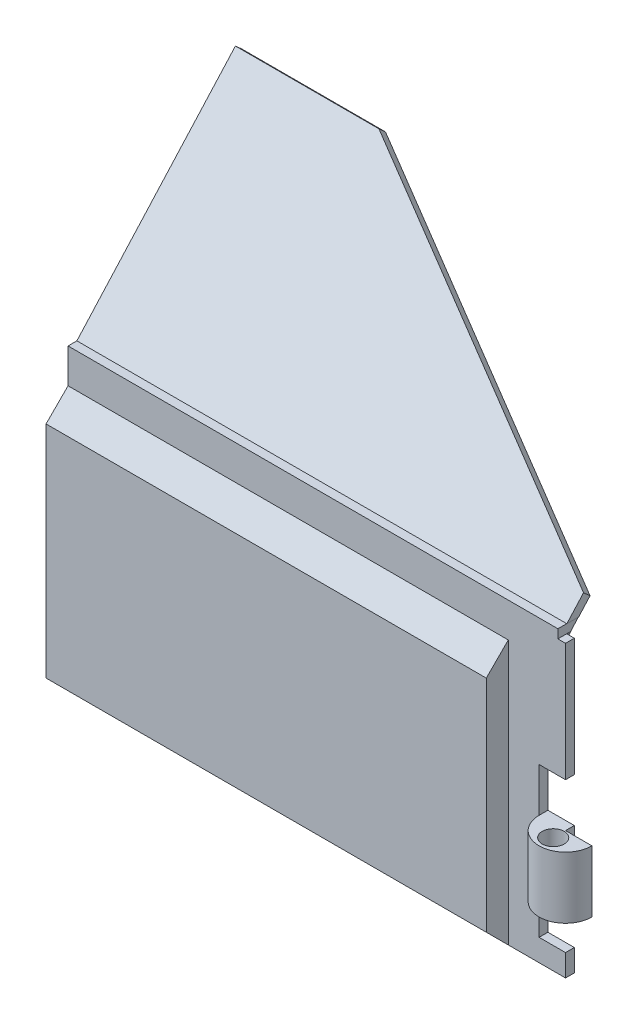
ISO-10303-21;
HEADER;
FILE_DESCRIPTION(('STEP AP214'),'2;1');
FILE_NAME('part.step','',(''),(''),'','','');
FILE_SCHEMA(('AUTOMOTIVE_DESIGN { 1 0 10303 214 1 1 1 1 }'));
ENDSEC;
DATA;
#1=APPLICATION_CONTEXT('core data for automotive mechanical design processes');
#2=APPLICATION_PROTOCOL_DEFINITION('international standard','automotive_design',2000,#1);
#3=PRODUCT_CONTEXT('',#1,'mechanical');
#4=PRODUCT('Part','Part','',(#3));
#5=PRODUCT_RELATED_PRODUCT_CATEGORY('part','',(#4));
#6=PRODUCT_DEFINITION_FORMATION('','',#4);
#7=PRODUCT_DEFINITION_CONTEXT('part definition',#1,'design');
#8=PRODUCT_DEFINITION('design','',#6,#7);
#9=PRODUCT_DEFINITION_SHAPE('','',#8);
#10=(LENGTH_UNIT() NAMED_UNIT(*) SI_UNIT(.MILLI.,.METRE.));
#11=(NAMED_UNIT(*) PLANE_ANGLE_UNIT() SI_UNIT($,.RADIAN.));
#12=(NAMED_UNIT(*) SI_UNIT($,.STERADIAN.) SOLID_ANGLE_UNIT());
#13=UNCERTAINTY_MEASURE_WITH_UNIT(LENGTH_MEASURE(1.E-05),#10,'distance_accuracy_value','');
#14=(GEOMETRIC_REPRESENTATION_CONTEXT(3) GLOBAL_UNCERTAINTY_ASSIGNED_CONTEXT((#13)) GLOBAL_UNIT_ASSIGNED_CONTEXT((#10,
#11,#12)) REPRESENTATION_CONTEXT('',''));
#15=CARTESIAN_POINT('',(0.,0.,0.));
#16=DIRECTION('',(0.,0.,1.));
#17=DIRECTION('',(1.,0.,0.));
#18=AXIS2_PLACEMENT_3D('',#15,#16,#17);
#19=CARTESIAN_POINT('',(27.4,-35.8801046027084,46.231811155793));
#20=DIRECTION('',(-1.,0.,0.));
#21=DIRECTION('',(0.,-1.,0.));
#22=AXIS2_PLACEMENT_3D('',#19,#20,#21);
#23=PLANE('',#22);
#24=DIRECTION('',(0.,0.743144825477395,-0.669130606358857));
#25=VECTOR('',#24,1.);
#26=CARTESIAN_POINT('',(27.4,-35.8801046027084,46.231811155793));
#27=LINE('',#26,#25);
#28=CARTESIAN_POINT('',(27.4,15.4655234501354,0.));
#29=VERTEX_POINT('',#28);
#30=CARTESIAN_POINT('',(27.4,15.96,-0.445228685308535));
#31=VERTEX_POINT('',#30);
#32=EDGE_CURVE('E227',#29,#31,#27,.T.);
#33=ORIENTED_EDGE('',*,*,#32,.T.);
#34=DIRECTION('',(0.,0.,1.));
#35=VECTOR('',#34,1.);
#36=CARTESIAN_POINT('',(27.4,15.96,46.231811155793));
#37=LINE('',#36,#35);
#38=CARTESIAN_POINT('',(27.4,15.96,0.));
#39=VERTEX_POINT('',#38);
#40=EDGE_CURVE('E11',#31,#39,#37,.T.);
#41=ORIENTED_EDGE('',*,*,#40,.T.);
#42=DIRECTION('',(0.,1.,0.));
#43=VECTOR('',#42,1.);
#44=CARTESIAN_POINT('',(27.4,-35.8801046027084,0.));
#45=LINE('',#44,#43);
#46=EDGE_CURVE('E212',#29,#39,#45,.T.);
#47=ORIENTED_EDGE('',*,*,#46,.F.);
#48=EDGE_LOOP('',(#33,#41,#47));
#49=FACE_BOUND('',#48,.T.);
#50=ADVANCED_FACE('F35',(#49),#23,.F.);
#51=CARTESIAN_POINT('',(25.25,2.54,1.));
#52=DIRECTION('',(0.,1.,0.));
#53=DIRECTION('',(0.,0.,1.));
#54=AXIS2_PLACEMENT_3D('',#51,#52,#53);
#55=PLANE('',#54);
#56=DIRECTION('',(1.,0.,0.));
#57=VECTOR('',#56,1.);
#58=CARTESIAN_POINT('',(25.25,2.54,0.));
#59=LINE('',#58,#57);
#60=CARTESIAN_POINT('',(25.25,2.54,0.));
#61=VERTEX_POINT('',#60);
#62=CARTESIAN_POINT('',(28.25,2.54,0.));
#63=VERTEX_POINT('',#62);
#64=EDGE_CURVE('E172',#61,#63,#59,.T.);
#65=ORIENTED_EDGE('',*,*,#64,.T.);
#66=DIRECTION('',(0.,0.,-1.));
#67=VECTOR('',#66,1.);
#68=CARTESIAN_POINT('',(28.25,2.54,1.));
#69=LINE('',#68,#67);
#70=CARTESIAN_POINT('',(28.25,2.54,1.));
#71=VERTEX_POINT('',#70);
#72=EDGE_CURVE('E43',#71,#63,#69,.T.);
#73=ORIENTED_EDGE('',*,*,#72,.F.);
#74=DIRECTION('',(1.,0.,0.));
#75=VECTOR('',#74,1.);
#76=CARTESIAN_POINT('',(25.25,2.54,1.));
#77=LINE('',#76,#75);
#78=CARTESIAN_POINT('',(25.25,2.54,1.));
#79=VERTEX_POINT('',#78);
#80=EDGE_CURVE('E173',#79,#71,#77,.T.);
#81=ORIENTED_EDGE('',*,*,#80,.F.);
#82=DIRECTION('',(0.,0.,-1.));
#83=VECTOR('',#82,1.);
#84=CARTESIAN_POINT('',(25.25,2.54,1.));
#85=LINE('',#84,#83);
#86=EDGE_CURVE('E189',#79,#61,#85,.T.);
#87=ORIENTED_EDGE('',*,*,#86,.T.);
#88=EDGE_LOOP('',(#65,#73,#81,#87));
#89=FACE_BOUND('',#88,.T.);
#90=ADVANCED_FACE('F37',(#89),#55,.F.);
#91=CARTESIAN_POINT('',(28.25,2.54,1.));
#92=DIRECTION('',(-1.,0.,0.));
#93=DIRECTION('',(0.,0.,1.));
#94=AXIS2_PLACEMENT_3D('',#91,#92,#93);
#95=PLANE('',#94);
#96=DIRECTION('',(0.,1.,0.));
#97=VECTOR('',#96,1.);
#98=CARTESIAN_POINT('',(28.25,2.54,0.));
#99=LINE('',#98,#97);
#100=CARTESIAN_POINT('',(28.25,15.96,0.));
#101=VERTEX_POINT('',#100);
#102=EDGE_CURVE('E192',#63,#101,#99,.T.);
#103=ORIENTED_EDGE('',*,*,#102,.T.);
#104=DIRECTION('',(0.,0.,1.));
#105=VECTOR('',#104,1.);
#106=CARTESIAN_POINT('',(28.25,15.96,-2.44997656798041));
#107=LINE('',#106,#105);
#108=CARTESIAN_POINT('',(28.25,15.96,1.));
#109=VERTEX_POINT('',#108);
#110=EDGE_CURVE('E488',#101,#109,#107,.T.);
#111=ORIENTED_EDGE('',*,*,#110,.T.);
#112=DIRECTION('',(0.,1.,0.));
#113=VECTOR('',#112,1.);
#114=CARTESIAN_POINT('',(28.25,2.54,1.));
#115=LINE('',#114,#113);
#116=EDGE_CURVE('E108',#71,#109,#115,.T.);
#117=ORIENTED_EDGE('',*,*,#116,.F.);
#118=ORIENTED_EDGE('',*,*,#72,.T.);
#119=EDGE_LOOP('',(#103,#111,#117,#118));
#120=FACE_BOUND('',#119,.T.);
#121=ADVANCED_FACE('F320',(#120),#95,.F.);
#122=CARTESIAN_POINT('',(28.25,16.96,1.));
#123=DIRECTION('',(0.,-1.,0.));
#124=DIRECTION('',(0.,0.,-1.));
#125=AXIS2_PLACEMENT_3D('',#122,#123,#124);
#126=PLANE('',#125);
#127=DIRECTION('',(-1.,0.,0.));
#128=VECTOR('',#127,1.);
#129=CARTESIAN_POINT('',(28.25,16.96,1.));
#130=LINE('',#129,#128);
#131=CARTESIAN_POINT('',(27.38,16.96,1.));
#132=VERTEX_POINT('',#131);
#133=CARTESIAN_POINT('',(-28.25,16.96,1.));
#134=VERTEX_POINT('',#133);
#135=EDGE_CURVE('E176',#132,#134,#130,.T.);
#136=ORIENTED_EDGE('',*,*,#135,.F.);
#137=DIRECTION('',(0.,0.,1.));
#138=VECTOR('',#137,1.);
#139=CARTESIAN_POINT('',(27.38,16.96,-2.44997656798041));
#140=LINE('',#139,#138);
#141=CARTESIAN_POINT('',(27.38,16.96,0.));
#142=VERTEX_POINT('',#141);
#143=EDGE_CURVE('E463',#142,#132,#140,.T.);
#144=ORIENTED_EDGE('',*,*,#143,.F.);
#145=DIRECTION('',(-1.,0.,0.));
#146=VECTOR('',#145,1.);
#147=CARTESIAN_POINT('',(28.25,16.96,0.));
#148=LINE('',#147,#146);
#149=CARTESIAN_POINT('',(-28.25,16.96,0.));
#150=VERTEX_POINT('',#149);
#151=EDGE_CURVE('E195',#142,#150,#148,.T.);
#152=ORIENTED_EDGE('',*,*,#151,.T.);
#153=DIRECTION('',(0.,0.,-1.));
#154=VECTOR('',#153,1.);
#155=CARTESIAN_POINT('',(-28.25,16.96,1.));
#156=LINE('',#155,#154);
#157=EDGE_CURVE('E314',#134,#150,#156,.T.);
#158=ORIENTED_EDGE('',*,*,#157,.F.);
#159=EDGE_LOOP('',(#136,#144,#152,#158));
#160=FACE_BOUND('',#159,.T.);
#161=ADVANCED_FACE('F477',(#160),#126,.F.);
#162=CARTESIAN_POINT('',(-28.25,-16.96,1.));
#163=DIRECTION('',(-1.,0.,0.));
#164=DIRECTION('',(0.,0.,1.));
#165=AXIS2_PLACEMENT_3D('',#162,#163,#164);
#166=PLANE('',#165);
#167=ORIENTED_EDGE('',*,*,#157,.T.);
#168=DIRECTION('',(0.,-0.743144825477395,0.669130606358857));
#169=VECTOR('',#168,1.);
#170=CARTESIAN_POINT('',(-28.25,16.4627390523159,0.447735768366172));
#171=LINE('',#170,#169);
#172=CARTESIAN_POINT('',(-28.25,36.9586733389824,-18.0068863550111));
#173=VERTEX_POINT('',#172);
#174=EDGE_CURVE('E347',#173,#150,#171,.T.);
#175=ORIENTED_EDGE('',*,*,#174,.F.);
#176=DIRECTION('',(0.,0.669130606358857,0.743144825477395));
#177=VECTOR('',#176,1.);
#178=CARTESIAN_POINT('',(-28.25,36.2895427326236,-18.7500311804885));
#179=LINE('',#178,#177);
#180=CARTESIAN_POINT('',(-28.25,36.2895427326236,-18.7500311804885));
#181=VERTEX_POINT('',#180);
#182=EDGE_CURVE('E213',#181,#173,#179,.T.);
#183=ORIENTED_EDGE('',*,*,#182,.F.);
#184=DIRECTION('',(0.,0.743144825477395,-0.669130606358857));
#185=VECTOR('',#184,1.);
#186=CARTESIAN_POINT('',(-28.25,-35.8801046027084,46.231811155793));
#187=LINE('',#186,#185);
#188=CARTESIAN_POINT('',(-28.25,15.4655234501354,0.));
#189=VERTEX_POINT('',#188);
#190=EDGE_CURVE('E216',#189,#181,#187,.T.);
#191=ORIENTED_EDGE('',*,*,#190,.F.);
#192=DIRECTION('',(0.,1.,0.));
#193=VECTOR('',#192,1.);
#194=CARTESIAN_POINT('',(-28.25,-16.96,0.));
#195=LINE('',#194,#193);
#196=CARTESIAN_POINT('',(-28.25,-16.96,0.));
#197=VERTEX_POINT('',#196);
#198=EDGE_CURVE('E204',#197,#189,#195,.T.);
#199=ORIENTED_EDGE('',*,*,#198,.F.);
#200=DIRECTION('',(0.,0.,-1.));
#201=VECTOR('',#200,1.);
#202=CARTESIAN_POINT('',(-28.25,-16.96,1.));
#203=LINE('',#202,#201);
#204=CARTESIAN_POINT('',(-28.25,-16.96,1.));
#205=VERTEX_POINT('',#204);
#206=EDGE_CURVE('E313',#205,#197,#203,.T.);
#207=ORIENTED_EDGE('',*,*,#206,.F.);
#208=DIRECTION('',(0.,0.707106781186551,0.707106781186544));
#209=VECTOR('',#208,1.);
#210=CARTESIAN_POINT('',(-28.25,-14.46,3.5));
#211=LINE('',#210,#209);
#212=CARTESIAN_POINT('',(-28.25,-14.46,3.5));
#213=VERTEX_POINT('',#212);
#214=EDGE_CURVE('E240',#205,#213,#211,.T.);
#215=ORIENTED_EDGE('',*,*,#214,.T.);
#216=DIRECTION('',(0.,1.,0.));
#217=VECTOR('',#216,1.);
#218=CARTESIAN_POINT('',(-28.25,10.54,3.5));
#219=LINE('',#218,#217);
#220=CARTESIAN_POINT('',(-28.25,10.54,3.5));
#221=VERTEX_POINT('',#220);
#222=EDGE_CURVE('E256',#213,#221,#219,.T.);
#223=ORIENTED_EDGE('',*,*,#222,.T.);
#224=DIRECTION('',(0.,0.707106781186544,-0.707106781186551));
#225=VECTOR('',#224,1.);
#226=CARTESIAN_POINT('',(-28.25,13.04,1.));
#227=LINE('',#226,#225);
#228=CARTESIAN_POINT('',(-28.25,13.04,1.));
#229=VERTEX_POINT('',#228);
#230=EDGE_CURVE('E50',#221,#229,#227,.T.);
#231=ORIENTED_EDGE('',*,*,#230,.T.);
#232=DIRECTION('',(0.,1.,0.));
#233=VECTOR('',#232,1.);
#234=CARTESIAN_POINT('',(-28.25,-16.96,1.));
#235=LINE('',#234,#233);
#236=EDGE_CURVE('E178',#229,#134,#235,.T.);
#237=ORIENTED_EDGE('',*,*,#236,.T.);
#238=EDGE_LOOP('',(#167,#175,#183,#191,#199,#207,#215,#223,#231,#237));
#239=FACE_BOUND('',#238,.T.);
#240=ADVANCED_FACE('F428',(#239),#166,.T.);
#241=CARTESIAN_POINT('',(28.25,-16.96,1.));
#242=DIRECTION('',(0.,-1.,0.));
#243=DIRECTION('',(0.,0.,-1.));
#244=AXIS2_PLACEMENT_3D('',#241,#242,#243);
#245=PLANE('',#244);
#246=DIRECTION('',(-1.,0.,0.));
#247=VECTOR('',#246,1.);
#248=CARTESIAN_POINT('',(28.25,-16.96,0.));
#249=LINE('',#248,#247);
#250=CARTESIAN_POINT('',(28.25,-16.96,0.));
#251=VERTEX_POINT('',#250);
#252=EDGE_CURVE('E201',#251,#197,#249,.T.);
#253=ORIENTED_EDGE('',*,*,#252,.F.);
#254=DIRECTION('',(0.,0.,-1.));
#255=VECTOR('',#254,1.);
#256=CARTESIAN_POINT('',(28.25,-16.96,1.));
#257=LINE('',#256,#255);
#258=CARTESIAN_POINT('',(28.25,-16.96,1.));
#259=VERTEX_POINT('',#258);
#260=EDGE_CURVE('E311',#259,#251,#257,.T.);
#261=ORIENTED_EDGE('',*,*,#260,.F.);
#262=DIRECTION('',(-1.,0.,0.));
#263=VECTOR('',#262,1.);
#264=CARTESIAN_POINT('',(28.25,-16.96,1.));
#265=LINE('',#264,#263);
#266=CARTESIAN_POINT('',(21.75,-16.96,1.));
#267=VERTEX_POINT('',#266);
#268=EDGE_CURVE('E180',#259,#267,#265,.T.);
#269=ORIENTED_EDGE('',*,*,#268,.T.);
#270=DIRECTION('',(-1.,0.,0.));
#271=VECTOR('',#270,1.);
#272=CARTESIAN_POINT('',(21.75,-16.96,1.));
#273=LINE('',#272,#271);
#274=EDGE_CURVE('E253',#267,#205,#273,.T.);
#275=ORIENTED_EDGE('',*,*,#274,.T.);
#276=ORIENTED_EDGE('',*,*,#206,.T.);
#277=EDGE_LOOP('',(#253,#261,#269,#275,#276));
#278=FACE_BOUND('',#277,.T.);
#279=ADVANCED_FACE('F425',(#278),#245,.T.);
#280=CARTESIAN_POINT('',(28.25,-16.96,1.));
#281=DIRECTION('',(-1.,0.,0.));
#282=DIRECTION('',(0.,0.,1.));
#283=AXIS2_PLACEMENT_3D('',#280,#281,#282);
#284=PLANE('',#283);
#285=DIRECTION('',(0.,1.,0.));
#286=VECTOR('',#285,1.);
#287=CARTESIAN_POINT('',(28.25,-16.96,0.));
#288=LINE('',#287,#286);
#289=CARTESIAN_POINT('',(28.25,-14.46,0.));
#290=VERTEX_POINT('',#289);
#291=EDGE_CURVE('E419',#251,#290,#288,.T.);
#292=ORIENTED_EDGE('',*,*,#291,.T.);
#293=DIRECTION('',(0.,0.,-1.));
#294=VECTOR('',#293,1.);
#295=CARTESIAN_POINT('',(28.25,-14.46,1.));
#296=LINE('',#295,#294);
#297=CARTESIAN_POINT('',(28.25,-14.46,1.));
#298=VERTEX_POINT('',#297);
#299=EDGE_CURVE('E308',#298,#290,#296,.T.);
#300=ORIENTED_EDGE('',*,*,#299,.F.);
#301=DIRECTION('',(0.,1.,0.));
#302=VECTOR('',#301,1.);
#303=CARTESIAN_POINT('',(28.25,-16.96,1.));
#304=LINE('',#303,#302);
#305=EDGE_CURVE('E183',#259,#298,#304,.T.);
#306=ORIENTED_EDGE('',*,*,#305,.F.);
#307=ORIENTED_EDGE('',*,*,#260,.T.);
#308=EDGE_LOOP('',(#292,#300,#306,#307));
#309=FACE_BOUND('',#308,.T.);
#310=ADVANCED_FACE('F552',(#309),#284,.F.);
#311=CARTESIAN_POINT('',(28.25,-14.46,1.));
#312=DIRECTION('',(0.,-1.,0.));
#313=DIRECTION('',(1.,0.,0.));
#314=AXIS2_PLACEMENT_3D('',#311,#312,#313);
#315=PLANE('',#314);
#316=DIRECTION('',(-1.,0.,0.));
#317=VECTOR('',#316,1.);
#318=CARTESIAN_POINT('',(28.25,-14.46,0.));
#319=LINE('',#318,#317);
#320=CARTESIAN_POINT('',(25.25,-14.46,0.));
#321=VERTEX_POINT('',#320);
#322=EDGE_CURVE('E296',#290,#321,#319,.T.);
#323=ORIENTED_EDGE('',*,*,#322,.T.);
#324=DIRECTION('',(0.,0.,-1.));
#325=VECTOR('',#324,1.);
#326=CARTESIAN_POINT('',(25.25,-14.46,1.));
#327=LINE('',#326,#325);
#328=CARTESIAN_POINT('',(25.25,-14.46,1.));
#329=VERTEX_POINT('',#328);
#330=EDGE_CURVE('E286',#329,#321,#327,.T.);
#331=ORIENTED_EDGE('',*,*,#330,.F.);
#332=DIRECTION('',(-1.,0.,0.));
#333=VECTOR('',#332,1.);
#334=CARTESIAN_POINT('',(28.25,-14.46,1.));
#335=LINE('',#334,#333);
#336=EDGE_CURVE('E185',#298,#329,#335,.T.);
#337=ORIENTED_EDGE('',*,*,#336,.F.);
#338=ORIENTED_EDGE('',*,*,#299,.T.);
#339=EDGE_LOOP('',(#323,#331,#337,#338));
#340=FACE_BOUND('',#339,.T.);
#341=ADVANCED_FACE('F416',(#340),#315,.F.);
#342=CARTESIAN_POINT('',(25.25,-14.46,1.));
#343=DIRECTION('',(-1.,0.,0.));
#344=DIRECTION('',(0.,0.,1.));
#345=AXIS2_PLACEMENT_3D('',#342,#343,#344);
#346=PLANE('',#345);
#347=DIRECTION('',(0.,1.,0.));
#348=VECTOR('',#347,1.);
#349=CARTESIAN_POINT('',(25.25,-14.46,0.));
#350=LINE('',#349,#348);
#351=CARTESIAN_POINT('',(25.25,-9.46,0.));
#352=VERTEX_POINT('',#351);
#353=EDGE_CURVE('E291',#321,#352,#350,.T.);
#354=ORIENTED_EDGE('',*,*,#353,.T.);
#355=DIRECTION('',(0.,0.,-1.));
#356=VECTOR('',#355,1.);
#357=CARTESIAN_POINT('',(25.25,-9.46,1.));
#358=LINE('',#357,#356);
#359=CARTESIAN_POINT('',(25.25,-9.46,1.));
#360=VERTEX_POINT('',#359);
#361=EDGE_CURVE('E142',#360,#352,#358,.T.);
#362=ORIENTED_EDGE('',*,*,#361,.F.);
#363=DIRECTION('',(0.,1.,0.));
#364=VECTOR('',#363,1.);
#365=CARTESIAN_POINT('',(25.25,-14.46,1.));
#366=LINE('',#365,#364);
#367=EDGE_CURVE('E152',#329,#360,#366,.T.);
#368=ORIENTED_EDGE('',*,*,#367,.F.);
#369=ORIENTED_EDGE('',*,*,#330,.T.);
#370=EDGE_LOOP('',(#354,#362,#368,#369));
#371=FACE_BOUND('',#370,.T.);
#372=ADVANCED_FACE('F414',(#371),#346,.F.);
#373=CARTESIAN_POINT('',(25.25,-9.46,1.));
#374=DIRECTION('',(0.,1.,0.));
#375=DIRECTION('',(0.,0.,1.));
#376=AXIS2_PLACEMENT_3D('',#373,#374,#375);
#377=PLANE('',#376);
#378=CARTESIAN_POINT('',(28.25,-9.46,2.4));
#379=DIRECTION('',(0.,1.,0.));
#380=DIRECTION('',(0.,0.,1.));
#381=AXIS2_PLACEMENT_3D('',#378,#379,#380);
#382=CIRCLE('',#381,1.25);
#383=CARTESIAN_POINT('',(28.25,-9.46,3.65));
#384=VERTEX_POINT('',#383);
#385=EDGE_CURVE('E162',#384,#384,#382,.F.);
#386=ORIENTED_EDGE('',*,*,#385,.F.);
#387=EDGE_LOOP('',(#386));
#388=FACE_BOUND('',#387,.T.);
#389=DIRECTION('',(1.,0.,0.));
#390=VECTOR('',#389,1.);
#391=CARTESIAN_POINT('',(25.25,-9.46,0.));
#392=LINE('',#391,#390);
#393=CARTESIAN_POINT('',(28.25,-9.46,0.));
#394=VERTEX_POINT('',#393);
#395=EDGE_CURVE('E139',#352,#394,#392,.T.);
#396=ORIENTED_EDGE('',*,*,#395,.T.);
#397=DIRECTION('',(0.,0.,-1.));
#398=VECTOR('',#397,1.);
#399=CARTESIAN_POINT('',(28.25,-9.46,1.));
#400=LINE('',#399,#398);
#401=CARTESIAN_POINT('',(28.25,-9.46,1.));
#402=VERTEX_POINT('',#401);
#403=EDGE_CURVE('E129',#402,#394,#400,.T.);
#404=ORIENTED_EDGE('',*,*,#403,.F.);
#405=DIRECTION('',(1.,0.,0.));
#406=VECTOR('',#405,1.);
#407=CARTESIAN_POINT('',(25.25,-9.46,1.));
#408=LINE('',#407,#406);
#409=CARTESIAN_POINT('',(31.25,-9.46,1.));
#410=VERTEX_POINT('',#409);
#411=EDGE_CURVE('E135',#402,#410,#408,.T.);
#412=ORIENTED_EDGE('',*,*,#411,.T.);
#413=CARTESIAN_POINT('',(28.25,-9.46,1.));
#414=DIRECTION('',(0.,-1.,0.));
#415=DIRECTION('',(0.,0.,-1.));
#416=AXIS2_PLACEMENT_3D('',#413,#414,#415);
#417=CIRCLE('',#416,3.);
#418=EDGE_CURVE('E158',#410,#360,#417,.T.);
#419=ORIENTED_EDGE('',*,*,#418,.T.);
#420=ORIENTED_EDGE('',*,*,#361,.T.);
#421=EDGE_LOOP('',(#396,#404,#412,#419,#420));
#422=FACE_BOUND('',#421,.T.);
#423=ADVANCED_FACE('F131',(#388,#422),#377,.F.);
#424=CARTESIAN_POINT('',(28.25,-9.46,1.));
#425=DIRECTION('',(-1.,0.,0.));
#426=DIRECTION('',(0.,-1.,0.));
#427=AXIS2_PLACEMENT_3D('',#424,#425,#426);
#428=PLANE('',#427);
#429=DIRECTION('',(0.,1.,0.));
#430=VECTOR('',#429,1.);
#431=CARTESIAN_POINT('',(28.25,-9.46,0.));
#432=LINE('',#431,#430);
#433=CARTESIAN_POINT('',(28.25,-2.46,0.));
#434=VERTEX_POINT('',#433);
#435=EDGE_CURVE('E292',#394,#434,#432,.T.);
#436=ORIENTED_EDGE('',*,*,#435,.T.);
#437=DIRECTION('',(0.,0.,-1.));
#438=VECTOR('',#437,1.);
#439=CARTESIAN_POINT('',(28.25,-2.46,1.));
#440=LINE('',#439,#438);
#441=CARTESIAN_POINT('',(28.25,-2.46,1.));
#442=VERTEX_POINT('',#441);
#443=EDGE_CURVE('E143',#442,#434,#440,.T.);
#444=ORIENTED_EDGE('',*,*,#443,.F.);
#445=DIRECTION('',(0.,1.,0.));
#446=VECTOR('',#445,1.);
#447=CARTESIAN_POINT('',(28.25,-9.46,1.));
#448=LINE('',#447,#446);
#449=EDGE_CURVE('E146',#402,#442,#448,.T.);
#450=ORIENTED_EDGE('',*,*,#449,.F.);
#451=ORIENTED_EDGE('',*,*,#403,.T.);
#452=EDGE_LOOP('',(#436,#444,#450,#451));
#453=FACE_BOUND('',#452,.T.);
#454=ADVANCED_FACE('F147',(#453),#428,.F.);
#455=CARTESIAN_POINT('',(28.25,-2.46,1.));
#456=DIRECTION('',(0.,-1.,0.));
#457=DIRECTION('',(0.,0.,-1.));
#458=AXIS2_PLACEMENT_3D('',#455,#456,#457);
#459=PLANE('',#458);
#460=CARTESIAN_POINT('',(28.25,-2.46,2.4));
#461=DIRECTION('',(0.,1.,0.));
#462=DIRECTION('',(0.,0.,1.));
#463=AXIS2_PLACEMENT_3D('',#460,#461,#462);
#464=CIRCLE('',#463,1.25);
#465=CARTESIAN_POINT('',(28.25,-2.46,3.65));
#466=VERTEX_POINT('',#465);
#467=EDGE_CURVE('E261',#466,#466,#464,.T.);
#468=ORIENTED_EDGE('',*,*,#467,.F.);
#469=EDGE_LOOP('',(#468));
#470=FACE_BOUND('',#469,.T.);
#471=DIRECTION('',(-1.,0.,0.));
#472=VECTOR('',#471,1.);
#473=CARTESIAN_POINT('',(28.25,-2.46,0.));
#474=LINE('',#473,#472);
#475=CARTESIAN_POINT('',(25.25,-2.46,0.));
#476=VERTEX_POINT('',#475);
#477=EDGE_CURVE('E294',#434,#476,#474,.T.);
#478=ORIENTED_EDGE('',*,*,#477,.T.);
#479=DIRECTION('',(0.,0.,-1.));
#480=VECTOR('',#479,1.);
#481=CARTESIAN_POINT('',(25.25,-2.46,1.));
#482=LINE('',#481,#480);
#483=CARTESIAN_POINT('',(25.25,-2.46,1.));
#484=VERTEX_POINT('',#483);
#485=EDGE_CURVE('E303',#484,#476,#482,.T.);
#486=ORIENTED_EDGE('',*,*,#485,.F.);
#487=CARTESIAN_POINT('',(28.25,-2.46,1.));
#488=DIRECTION('',(0.,-1.,0.));
#489=DIRECTION('',(0.,0.,-1.));
#490=AXIS2_PLACEMENT_3D('',#487,#488,#489);
#491=CIRCLE('',#490,3.);
#492=CARTESIAN_POINT('',(31.25,-2.46,1.));
#493=VERTEX_POINT('',#492);
#494=EDGE_CURVE('E169',#484,#493,#491,.F.);
#495=ORIENTED_EDGE('',*,*,#494,.T.);
#496=DIRECTION('',(-1.,0.,0.));
#497=VECTOR('',#496,1.);
#498=CARTESIAN_POINT('',(25.25,-2.46,1.));
#499=LINE('',#498,#497);
#500=EDGE_CURVE('E167',#493,#442,#499,.T.);
#501=ORIENTED_EDGE('',*,*,#500,.T.);
#502=ORIENTED_EDGE('',*,*,#443,.T.);
#503=EDGE_LOOP('',(#478,#486,#495,#501,#502));
#504=FACE_BOUND('',#503,.T.);
#505=ADVANCED_FACE('F274',(#470,#504),#459,.F.);
#506=CARTESIAN_POINT('',(25.25,-2.46,1.));
#507=DIRECTION('',(-1.,0.,0.));
#508=DIRECTION('',(0.,0.,1.));
#509=AXIS2_PLACEMENT_3D('',#506,#507,#508);
#510=PLANE('',#509);
#511=DIRECTION('',(0.,1.,0.));
#512=VECTOR('',#511,1.);
#513=CARTESIAN_POINT('',(25.25,-2.46,0.));
#514=LINE('',#513,#512);
#515=EDGE_CURVE('E99',#476,#61,#514,.T.);
#516=ORIENTED_EDGE('',*,*,#515,.T.);
#517=ORIENTED_EDGE('',*,*,#86,.F.);
#518=DIRECTION('',(0.,1.,0.));
#519=VECTOR('',#518,1.);
#520=CARTESIAN_POINT('',(25.25,-2.46,1.));
#521=LINE('',#520,#519);
#522=EDGE_CURVE('E59',#484,#79,#521,.T.);
#523=ORIENTED_EDGE('',*,*,#522,.F.);
#524=ORIENTED_EDGE('',*,*,#485,.T.);
#525=EDGE_LOOP('',(#516,#517,#523,#524));
#526=FACE_BOUND('',#525,.T.);
#527=ADVANCED_FACE('F409',(#526),#510,.F.);
#528=CARTESIAN_POINT('',(0.,0.,1.));
#529=DIRECTION('',(0.,0.,1.));
#530=DIRECTION('',(1.,0.,0.));
#531=AXIS2_PLACEMENT_3D('',#528,#529,#530);
#532=PLANE('',#531);
#533=DIRECTION('',(1.,0.,0.));
#534=VECTOR('',#533,1.);
#535=CARTESIAN_POINT('',(28.25,15.96,1.));
#536=LINE('',#535,#534);
#537=CARTESIAN_POINT('',(27.38,15.96,1.));
#538=VERTEX_POINT('',#537);
#539=EDGE_CURVE('E473',#538,#109,#536,.T.);
#540=ORIENTED_EDGE('',*,*,#539,.F.);
#541=DIRECTION('',(0.,-1.,0.));
#542=VECTOR('',#541,1.);
#543=CARTESIAN_POINT('',(27.38,16.96,1.));
#544=LINE('',#543,#542);
#545=EDGE_CURVE('E467',#132,#538,#544,.T.);
#546=ORIENTED_EDGE('',*,*,#545,.F.);
#547=ORIENTED_EDGE('',*,*,#135,.T.);
#548=ORIENTED_EDGE('',*,*,#236,.F.);
#549=DIRECTION('',(-1.,0.,0.));
#550=VECTOR('',#549,1.);
#551=CARTESIAN_POINT('',(21.75,13.04,1.));
#552=LINE('',#551,#550);
#553=CARTESIAN_POINT('',(21.75,13.04,1.));
#554=VERTEX_POINT('',#553);
#555=EDGE_CURVE('E259',#554,#229,#552,.T.);
#556=ORIENTED_EDGE('',*,*,#555,.F.);
#557=DIRECTION('',(0.,-1.,0.));
#558=VECTOR('',#557,1.);
#559=CARTESIAN_POINT('',(21.75,-16.96,1.));
#560=LINE('',#559,#558);
#561=EDGE_CURVE('E241',#554,#267,#560,.T.);
#562=ORIENTED_EDGE('',*,*,#561,.T.);
#563=ORIENTED_EDGE('',*,*,#268,.F.);
#564=ORIENTED_EDGE('',*,*,#305,.T.);
#565=ORIENTED_EDGE('',*,*,#336,.T.);
#566=ORIENTED_EDGE('',*,*,#367,.T.);
#567=DIRECTION('',(0.,-1.,0.));
#568=VECTOR('',#567,1.);
#569=CARTESIAN_POINT('',(25.25,4.24820393249938,1.));
#570=LINE('',#569,#568);
#571=EDGE_CURVE('E160',#484,#360,#570,.T.);
#572=ORIENTED_EDGE('',*,*,#571,.F.);
#573=ORIENTED_EDGE('',*,*,#522,.T.);
#574=ORIENTED_EDGE('',*,*,#80,.T.);
#575=ORIENTED_EDGE('',*,*,#116,.T.);
#576=EDGE_LOOP('',(#540,#546,#547,#548,#556,#562,#563,#564,#565,#566,#572,#573,#574,#575));
#577=FACE_BOUND('',#576,.T.);
#578=ADVANCED_FACE('F411',(#577),#532,.T.);
#579=CARTESIAN_POINT('',(0.,0.,0.));
#580=DIRECTION('',(0.,0.,1.));
#581=DIRECTION('',(1.,0.,0.));
#582=AXIS2_PLACEMENT_3D('',#579,#580,#581);
#583=PLANE('',#582);
#584=ORIENTED_EDGE('',*,*,#46,.T.);
#585=DIRECTION('',(1.,0.,0.));
#586=VECTOR('',#585,1.);
#587=CARTESIAN_POINT('',(0.,15.96,0.));
#588=LINE('',#587,#586);
#589=EDGE_CURVE('E326',#39,#101,#588,.T.);
#590=ORIENTED_EDGE('',*,*,#589,.T.);
#591=ORIENTED_EDGE('',*,*,#102,.F.);
#592=ORIENTED_EDGE('',*,*,#64,.F.);
#593=ORIENTED_EDGE('',*,*,#515,.F.);
#594=ORIENTED_EDGE('',*,*,#477,.F.);
#595=ORIENTED_EDGE('',*,*,#435,.F.);
#596=ORIENTED_EDGE('',*,*,#395,.F.);
#597=ORIENTED_EDGE('',*,*,#353,.F.);
#598=ORIENTED_EDGE('',*,*,#322,.F.);
#599=ORIENTED_EDGE('',*,*,#291,.F.);
#600=ORIENTED_EDGE('',*,*,#252,.T.);
#601=ORIENTED_EDGE('',*,*,#198,.T.);
#602=DIRECTION('',(1.,0.,0.));
#603=VECTOR('',#602,1.);
#604=CARTESIAN_POINT('',(-28.25,15.4655234501354,0.));
#605=LINE('',#604,#603);
#606=EDGE_CURVE('E209',#189,#29,#605,.T.);
#607=ORIENTED_EDGE('',*,*,#606,.T.);
#608=EDGE_LOOP('',(#584,#590,#591,#592,#593,#594,#595,#596,#597,#598,#599,#600,#601,#607));
#609=FACE_BOUND('',#608,.T.);
#610=ADVANCED_FACE('F289',(#609),#583,.F.);
#611=CARTESIAN_POINT('',(25.25,4.24820393249938,1.));
#612=DIRECTION('',(0.,0.,-1.));
#613=DIRECTION('',(-1.,0.,0.));
#614=AXIS2_PLACEMENT_3D('',#611,#612,#613);
#615=PLANE('',#614);
#616=ORIENTED_EDGE('',*,*,#449,.T.);
#617=ORIENTED_EDGE('',*,*,#500,.F.);
#618=DIRECTION('',(0.,-1.,0.));
#619=VECTOR('',#618,1.);
#620=CARTESIAN_POINT('',(31.25,4.24820393249938,1.));
#621=LINE('',#620,#619);
#622=EDGE_CURVE('E156',#493,#410,#621,.T.);
#623=ORIENTED_EDGE('',*,*,#622,.T.);
#624=ORIENTED_EDGE('',*,*,#411,.F.);
#625=EDGE_LOOP('',(#616,#617,#623,#624));
#626=FACE_BOUND('',#625,.T.);
#627=ADVANCED_FACE('F154',(#626),#615,.T.);
#628=CARTESIAN_POINT('',(28.25,4.24820393249938,1.));
#629=DIRECTION('',(0.,-1.,0.));
#630=DIRECTION('',(0.,0.,-1.));
#631=AXIS2_PLACEMENT_3D('',#628,#629,#630);
#632=CYLINDRICAL_SURFACE('',#631,3.);
#633=ORIENTED_EDGE('',*,*,#494,.F.);
#634=ORIENTED_EDGE('',*,*,#571,.T.);
#635=ORIENTED_EDGE('',*,*,#418,.F.);
#636=ORIENTED_EDGE('',*,*,#622,.F.);
#637=EDGE_LOOP('',(#633,#634,#635,#636));
#638=FACE_BOUND('',#637,.T.);
#639=ADVANCED_FACE('F280',(#638),#632,.T.);
#640=CARTESIAN_POINT('',(28.25,-12.9955339059327,2.4));
#641=DIRECTION('',(0.,1.,0.));
#642=DIRECTION('',(0.,0.,1.));
#643=AXIS2_PLACEMENT_3D('',#640,#641,#642);
#644=CYLINDRICAL_SURFACE('',#643,1.25);
#645=ORIENTED_EDGE('',*,*,#385,.T.);
#646=EDGE_LOOP('',(#645));
#647=FACE_BOUND('',#646,.T.);
#648=ORIENTED_EDGE('',*,*,#467,.T.);
#649=EDGE_LOOP('',(#648));
#650=FACE_BOUND('',#649,.T.);
#651=ADVANCED_FACE('F519',(#647,#650),#644,.F.);
#652=CARTESIAN_POINT('',(21.75,13.04,1.));
#653=DIRECTION('',(0.,0.707106781186551,0.707106781186544));
#654=DIRECTION('',(0.,-0.707106781186544,0.707106781186551));
#655=AXIS2_PLACEMENT_3D('',#652,#653,#654);
#656=PLANE('',#655);
#657=ORIENTED_EDGE('',*,*,#230,.F.);
#658=DIRECTION('',(-1.,0.,0.));
#659=VECTOR('',#658,1.);
#660=CARTESIAN_POINT('',(21.75,10.54,3.5));
#661=LINE('',#660,#659);
#662=CARTESIAN_POINT('',(21.75,10.54,3.5));
#663=VERTEX_POINT('',#662);
#664=EDGE_CURVE('E262',#663,#221,#661,.T.);
#665=ORIENTED_EDGE('',*,*,#664,.F.);
#666=DIRECTION('',(0.,0.707106781186544,-0.707106781186551));
#667=VECTOR('',#666,1.);
#668=CARTESIAN_POINT('',(21.75,13.04,1.));
#669=LINE('',#668,#667);
#670=EDGE_CURVE('E250',#663,#554,#669,.T.);
#671=ORIENTED_EDGE('',*,*,#670,.T.);
#672=ORIENTED_EDGE('',*,*,#555,.T.);
#673=EDGE_LOOP('',(#657,#665,#671,#672));
#674=FACE_BOUND('',#673,.T.);
#675=ADVANCED_FACE('F515',(#674),#656,.T.);
#676=CARTESIAN_POINT('',(21.75,10.54,3.5));
#677=DIRECTION('',(0.,0.,1.));
#678=DIRECTION('',(0.,-1.,0.));
#679=AXIS2_PLACEMENT_3D('',#676,#677,#678);
#680=PLANE('',#679);
#681=ORIENTED_EDGE('',*,*,#222,.F.);
#682=DIRECTION('',(-1.,0.,0.));
#683=VECTOR('',#682,1.);
#684=CARTESIAN_POINT('',(21.75,-14.46,3.5));
#685=LINE('',#684,#683);
#686=CARTESIAN_POINT('',(21.75,-14.46,3.5));
#687=VERTEX_POINT('',#686);
#688=EDGE_CURVE('E265',#687,#213,#685,.T.);
#689=ORIENTED_EDGE('',*,*,#688,.F.);
#690=DIRECTION('',(0.,1.,0.));
#691=VECTOR('',#690,1.);
#692=CARTESIAN_POINT('',(21.75,10.54,3.5));
#693=LINE('',#692,#691);
#694=EDGE_CURVE('E247',#687,#663,#693,.T.);
#695=ORIENTED_EDGE('',*,*,#694,.T.);
#696=ORIENTED_EDGE('',*,*,#664,.T.);
#697=EDGE_LOOP('',(#681,#689,#695,#696));
#698=FACE_BOUND('',#697,.T.);
#699=ADVANCED_FACE('F518',(#698),#680,.T.);
#700=CARTESIAN_POINT('',(21.75,-14.46,3.5));
#701=DIRECTION('',(0.,-0.707106781186544,0.707106781186551));
#702=DIRECTION('',(0.,-0.707106781186551,-0.707106781186544));
#703=AXIS2_PLACEMENT_3D('',#700,#701,#702);
#704=PLANE('',#703);
#705=ORIENTED_EDGE('',*,*,#214,.F.);
#706=ORIENTED_EDGE('',*,*,#274,.F.);
#707=DIRECTION('',(0.,0.707106781186551,0.707106781186544));
#708=VECTOR('',#707,1.);
#709=CARTESIAN_POINT('',(21.75,-14.46,3.5));
#710=LINE('',#709,#708);
#711=EDGE_CURVE('E244',#267,#687,#710,.T.);
#712=ORIENTED_EDGE('',*,*,#711,.T.);
#713=ORIENTED_EDGE('',*,*,#688,.T.);
#714=EDGE_LOOP('',(#705,#706,#712,#713));
#715=FACE_BOUND('',#714,.T.);
#716=ADVANCED_FACE('F511',(#715),#704,.T.);
#717=CARTESIAN_POINT('',(21.75,0.,0.));
#718=DIRECTION('',(1.,0.,0.));
#719=DIRECTION('',(0.,0.,-1.));
#720=AXIS2_PLACEMENT_3D('',#717,#718,#719);
#721=PLANE('',#720);
#722=ORIENTED_EDGE('',*,*,#561,.F.);
#723=ORIENTED_EDGE('',*,*,#670,.F.);
#724=ORIENTED_EDGE('',*,*,#694,.F.);
#725=ORIENTED_EDGE('',*,*,#711,.F.);
#726=EDGE_LOOP('',(#722,#723,#724,#725));
#727=FACE_BOUND('',#726,.T.);
#728=ADVANCED_FACE('F507',(#727),#721,.T.);
#729=CARTESIAN_POINT('',(-28.25,-35.8801046027084,46.231811155793));
#730=DIRECTION('',(0.,0.669130606358857,0.743144825477395));
#731=DIRECTION('',(0.,-0.743144825477395,0.669130606358857));
#732=AXIS2_PLACEMENT_3D('',#729,#730,#731);
#733=PLANE('',#732);
#734=DIRECTION('',(0.,0.743144825477395,-0.669130606358857));
#735=VECTOR('',#734,1.);
#736=CARTESIAN_POINT('',(27.38,17.509147063639,-1.84008696662122));
#737=LINE('',#736,#735);
#738=CARTESIAN_POINT('',(27.38,15.96,-0.44522868530853));
#739=VERTEX_POINT('',#738);
#740=CARTESIAN_POINT('',(27.38,16.96,-1.34563272960637));
#741=VERTEX_POINT('',#740);
#742=EDGE_CURVE('E482',#739,#741,#737,.T.);
#743=ORIENTED_EDGE('',*,*,#742,.F.);
#744=DIRECTION('',(-1.,0.,0.));
#745=VECTOR('',#744,1.);
#746=CARTESIAN_POINT('',(28.25,15.96,-0.445228685308535));
#747=LINE('',#746,#745);
#748=EDGE_CURVE('E483',#31,#739,#747,.T.);
#749=ORIENTED_EDGE('',*,*,#748,.F.);
#750=ORIENTED_EDGE('',*,*,#32,.F.);
#751=ORIENTED_EDGE('',*,*,#606,.F.);
#752=ORIENTED_EDGE('',*,*,#190,.T.);
#753=DIRECTION('',(-1.,0.,0.));
#754=VECTOR('',#753,1.);
#755=CARTESIAN_POINT('',(-28.25,36.2895427326236,-18.7500311804885));
#756=LINE('',#755,#754);
#757=CARTESIAN_POINT('',(-11.95,36.2895427326236,-18.7500311804885));
#758=VERTEX_POINT('',#757);
#759=EDGE_CURVE('E346',#758,#181,#756,.T.);
#760=ORIENTED_EDGE('',*,*,#759,.F.);
#761=DIRECTION('',(-0.852965542672275,0.387897241643859,-0.349264245148106));
#762=VECTOR('',#761,1.);
#763=CARTESIAN_POINT('',(-11.95,36.2895427326236,-18.7500311804885));
#764=LINE('',#763,#762);
#765=CARTESIAN_POINT('',(27.4,18.3946153351279,-2.63736617936722));
#766=VERTEX_POINT('',#765);
#767=EDGE_CURVE('E343',#766,#758,#764,.T.);
#768=ORIENTED_EDGE('',*,*,#767,.F.);
#769=CARTESIAN_POINT('',(27.4,16.96,-1.34563272960637));
#770=VERTEX_POINT('',#769);
#771=EDGE_CURVE('E218',#770,#766,#27,.T.);
#772=ORIENTED_EDGE('',*,*,#771,.F.);
#773=DIRECTION('',(1.,0.,0.));
#774=VECTOR('',#773,1.);
#775=CARTESIAN_POINT('',(28.25,16.96,-1.34563272960637));
#776=LINE('',#775,#774);
#777=EDGE_CURVE('E339',#741,#770,#776,.T.);
#778=ORIENTED_EDGE('',*,*,#777,.F.);
#779=EDGE_LOOP('',(#743,#749,#750,#751,#752,#760,#768,#772,#778));
#780=FACE_BOUND('',#779,.T.);
#781=ADVANCED_FACE('F433',(#780),#733,.F.);
#782=DIRECTION('',(0.,0.743144825477396,-0.669130606358857));
#783=VECTOR('',#782,1.);
#784=CARTESIAN_POINT('',(27.4,19.0637459414868,-1.89422135388983));
#785=LINE('',#784,#783);
#786=CARTESIAN_POINT('',(27.4,16.96,0.));
#787=VERTEX_POINT('',#786);
#788=CARTESIAN_POINT('',(27.4,19.0637459414868,-1.89422135388983));
#789=VERTEX_POINT('',#788);
#790=EDGE_CURVE('E332',#787,#789,#785,.T.);
#791=ORIENTED_EDGE('',*,*,#790,.F.);
#792=DIRECTION('',(0.,0.,-1.));
#793=VECTOR('',#792,1.);
#794=CARTESIAN_POINT('',(27.4,16.96,46.231811155793));
#795=LINE('',#794,#793);
#796=EDGE_CURVE('E333',#787,#770,#795,.T.);
#797=ORIENTED_EDGE('',*,*,#796,.T.);
#798=ORIENTED_EDGE('',*,*,#771,.T.);
#799=DIRECTION('',(0.,0.669130606358857,0.743144825477395));
#800=VECTOR('',#799,1.);
#801=CARTESIAN_POINT('',(27.4,18.3946153351279,-2.63736617936722));
#802=LINE('',#801,#800);
#803=EDGE_CURVE('E236',#766,#789,#802,.T.);
#804=ORIENTED_EDGE('',*,*,#803,.T.);
#805=EDGE_LOOP('',(#791,#797,#798,#804));
#806=FACE_BOUND('',#805,.T.);
#807=ADVANCED_FACE('F370',(#806),#23,.F.);
#808=CARTESIAN_POINT('',(0.,7.59359863149027,8.43354567272296));
#809=DIRECTION('',(0.,-0.669130606358857,-0.743144825477395));
#810=DIRECTION('',(0.,0.743144825477395,-0.669130606358857));
#811=AXIS2_PLACEMENT_3D('',#808,#809,#810);
#812=PLANE('',#811);
#813=ORIENTED_EDGE('',*,*,#174,.T.);
#814=ORIENTED_EDGE('',*,*,#151,.F.);
#815=EDGE_CURVE('E198',#787,#142,#148,.T.);
#816=ORIENTED_EDGE('',*,*,#815,.F.);
#817=ORIENTED_EDGE('',*,*,#790,.T.);
#818=DIRECTION('',(-0.852965542672275,0.387897241643859,-0.349264245148106));
#819=VECTOR('',#818,1.);
#820=CARTESIAN_POINT('',(-11.95,36.9586733389824,-18.0068863550111));
#821=LINE('',#820,#819);
#822=CARTESIAN_POINT('',(-11.95,36.9586733389824,-18.0068863550111));
#823=VERTEX_POINT('',#822);
#824=EDGE_CURVE('E336',#789,#823,#821,.T.);
#825=ORIENTED_EDGE('',*,*,#824,.T.);
#826=DIRECTION('',(-1.,0.,0.));
#827=VECTOR('',#826,1.);
#828=CARTESIAN_POINT('',(-28.25,36.9586733389824,-18.0068863550111));
#829=LINE('',#828,#827);
#830=EDGE_CURVE('E352',#823,#173,#829,.T.);
#831=ORIENTED_EDGE('',*,*,#830,.T.);
#832=EDGE_LOOP('',(#813,#814,#816,#817,#825,#831));
#833=FACE_BOUND('',#832,.T.);
#834=ADVANCED_FACE('F378',(#833),#812,.F.);
#835=CARTESIAN_POINT('',(-28.25,36.2895427326236,-18.7500311804885));
#836=DIRECTION('',(0.,0.743144825477395,-0.669130606358857));
#837=DIRECTION('',(0.,0.669130606358857,0.743144825477395));
#838=AXIS2_PLACEMENT_3D('',#835,#836,#837);
#839=PLANE('',#838);
#840=ORIENTED_EDGE('',*,*,#830,.F.);
#841=DIRECTION('',(0.,0.669130606358857,0.743144825477395));
#842=VECTOR('',#841,1.);
#843=CARTESIAN_POINT('',(-11.95,36.2895427326236,-18.7500311804885));
#844=LINE('',#843,#842);
#845=EDGE_CURVE('E358',#758,#823,#844,.T.);
#846=ORIENTED_EDGE('',*,*,#845,.F.);
#847=ORIENTED_EDGE('',*,*,#759,.T.);
#848=ORIENTED_EDGE('',*,*,#182,.T.);
#849=EDGE_LOOP('',(#840,#846,#847,#848));
#850=FACE_BOUND('',#849,.T.);
#851=ADVANCED_FACE('F431',(#850),#839,.T.);
#852=CARTESIAN_POINT('',(-11.95,36.2895427326236,-18.7500311804885));
#853=DIRECTION('',(0.52196722408001,0.63387692934742,-0.570745350771511));
#854=DIRECTION('',(0.,0.669130606358857,0.743144825477396));
#855=AXIS2_PLACEMENT_3D('',#852,#853,#854);
#856=PLANE('',#855);
#857=ORIENTED_EDGE('',*,*,#824,.F.);
#858=ORIENTED_EDGE('',*,*,#803,.F.);
#859=ORIENTED_EDGE('',*,*,#767,.T.);
#860=ORIENTED_EDGE('',*,*,#845,.T.);
#861=EDGE_LOOP('',(#857,#858,#859,#860));
#862=FACE_BOUND('',#861,.T.);
#863=ADVANCED_FACE('F376',(#862),#856,.T.);
#864=CARTESIAN_POINT('',(28.25,15.96,-2.44997656798041));
#865=DIRECTION('',(0.,-1.,0.));
#866=DIRECTION('',(0.,0.,-1.));
#867=AXIS2_PLACEMENT_3D('',#864,#865,#866);
#868=PLANE('',#867);
#869=ORIENTED_EDGE('',*,*,#40,.F.);
#870=ORIENTED_EDGE('',*,*,#748,.T.);
#871=DIRECTION('',(0.,0.,1.));
#872=VECTOR('',#871,1.);
#873=CARTESIAN_POINT('',(27.38,15.96,-2.44997656798041));
#874=LINE('',#873,#872);
#875=EDGE_CURVE('E486',#739,#538,#874,.T.);
#876=ORIENTED_EDGE('',*,*,#875,.T.);
#877=ORIENTED_EDGE('',*,*,#539,.T.);
#878=ORIENTED_EDGE('',*,*,#110,.F.);
#879=ORIENTED_EDGE('',*,*,#589,.F.);
#880=EDGE_LOOP('',(#869,#870,#876,#877,#878,#879));
#881=FACE_BOUND('',#880,.T.);
#882=ADVANCED_FACE('F491',(#881),#868,.F.);
#883=CARTESIAN_POINT('',(28.25,16.96,-2.44997656798041));
#884=DIRECTION('',(0.,1.,0.));
#885=DIRECTION('',(0.,0.,1.));
#886=AXIS2_PLACEMENT_3D('',#883,#884,#885);
#887=PLANE('',#886);
#888=ORIENTED_EDGE('',*,*,#815,.T.);
#889=EDGE_CURVE('E469',#741,#142,#140,.T.);
#890=ORIENTED_EDGE('',*,*,#889,.F.);
#891=ORIENTED_EDGE('',*,*,#777,.T.);
#892=ORIENTED_EDGE('',*,*,#796,.F.);
#893=EDGE_LOOP('',(#888,#890,#891,#892));
#894=FACE_BOUND('',#893,.T.);
#895=ADVANCED_FACE('F479',(#894),#887,.F.);
#896=CARTESIAN_POINT('',(27.38,16.96,-2.44997656798041));
#897=DIRECTION('',(-1.,0.,0.));
#898=DIRECTION('',(0.,0.,1.));
#899=AXIS2_PLACEMENT_3D('',#896,#897,#898);
#900=PLANE('',#899);
#901=ORIENTED_EDGE('',*,*,#742,.T.);
#902=ORIENTED_EDGE('',*,*,#889,.T.);
#903=ORIENTED_EDGE('',*,*,#143,.T.);
#904=ORIENTED_EDGE('',*,*,#545,.T.);
#905=ORIENTED_EDGE('',*,*,#875,.F.);
#906=EDGE_LOOP('',(#901,#902,#903,#904,#905));
#907=FACE_BOUND('',#906,.T.);
#908=ADVANCED_FACE('F465',(#907),#900,.F.);
#909=CLOSED_SHELL('',(#50,#90,#121,#161,#240,#279,#310,#341,#372,#423,#454,#505,#527,#578,#610,
#627,#639,#651,#675,#699,#716,#728,#781,#807,#834,#851,#863,#882,#895,#908));
#910=MANIFOLD_SOLID_BREP('B2',#909);
#911=ADVANCED_BREP_SHAPE_REPRESENTATION('',(#18,#910),#14);
#912=SHAPE_DEFINITION_REPRESENTATION(#9,#911);
ENDSEC;
END-ISO-10303-21;
